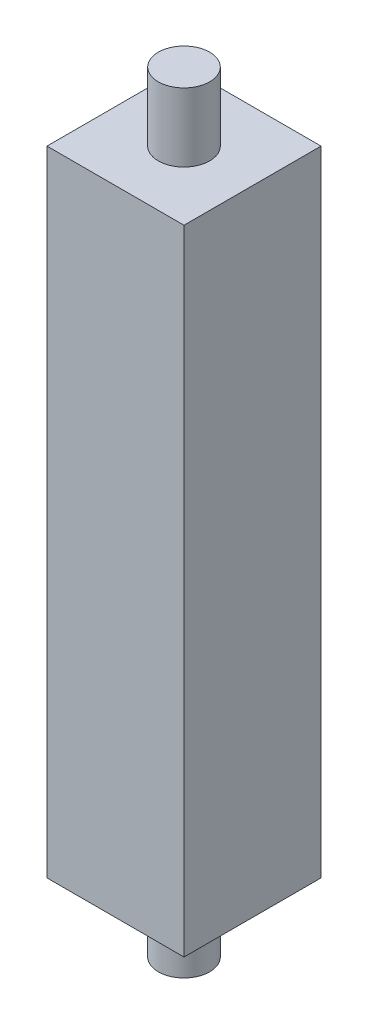
ISO-10303-21;
HEADER;
FILE_DESCRIPTION(('STEP AP214'),'2;1');
FILE_NAME('part.step','',(''),(''),'','','');
FILE_SCHEMA(('AUTOMOTIVE_DESIGN { 1 0 10303 214 1 1 1 1 }'));
ENDSEC;
DATA;
#1=APPLICATION_CONTEXT('core data for automotive mechanical design processes');
#2=APPLICATION_PROTOCOL_DEFINITION('international standard','automotive_design',2000,#1);
#3=PRODUCT_CONTEXT('',#1,'mechanical');
#4=PRODUCT('Part','Part','',(#3));
#5=PRODUCT_RELATED_PRODUCT_CATEGORY('part','',(#4));
#6=PRODUCT_DEFINITION_FORMATION('','',#4);
#7=PRODUCT_DEFINITION_CONTEXT('part definition',#1,'design');
#8=PRODUCT_DEFINITION('design','',#6,#7);
#9=PRODUCT_DEFINITION_SHAPE('','',#8);
#10=(LENGTH_UNIT() NAMED_UNIT(*) SI_UNIT(.MILLI.,.METRE.));
#11=(NAMED_UNIT(*) PLANE_ANGLE_UNIT() SI_UNIT($,.RADIAN.));
#12=(NAMED_UNIT(*) SI_UNIT($,.STERADIAN.) SOLID_ANGLE_UNIT());
#13=UNCERTAINTY_MEASURE_WITH_UNIT(LENGTH_MEASURE(1.E-05),#10,'distance_accuracy_value','');
#14=(GEOMETRIC_REPRESENTATION_CONTEXT(3) GLOBAL_UNCERTAINTY_ASSIGNED_CONTEXT((#13)) GLOBAL_UNIT_ASSIGNED_CONTEXT((#10,
#11,#12)) REPRESENTATION_CONTEXT('',''));
#15=CARTESIAN_POINT('',(0.,0.,0.));
#16=DIRECTION('',(0.,0.,1.));
#17=DIRECTION('',(1.,0.,0.));
#18=AXIS2_PLACEMENT_3D('',#15,#16,#17);
#19=CARTESIAN_POINT('',(20.,185.,-20.));
#20=DIRECTION('',(-1.,0.,0.));
#21=DIRECTION('',(0.,0.,1.));
#22=AXIS2_PLACEMENT_3D('',#19,#20,#21);
#23=PLANE('',#22);
#24=DIRECTION('',(0.,0.,-1.));
#25=VECTOR('',#24,1.);
#26=CARTESIAN_POINT('',(20.,0.,-20.));
#27=LINE('',#26,#25);
#28=CARTESIAN_POINT('',(20.,0.,20.));
#29=VERTEX_POINT('',#28);
#30=CARTESIAN_POINT('',(20.,0.,-20.));
#31=VERTEX_POINT('',#30);
#32=EDGE_CURVE('E112',#29,#31,#27,.T.);
#33=ORIENTED_EDGE('',*,*,#32,.T.);
#34=DIRECTION('',(0.,-1.,0.));
#35=VECTOR('',#34,1.);
#36=CARTESIAN_POINT('',(20.,185.,-20.));
#37=LINE('',#36,#35);
#38=CARTESIAN_POINT('',(20.,185.,-20.));
#39=VERTEX_POINT('',#38);
#40=EDGE_CURVE('E49',#39,#31,#37,.T.);
#41=ORIENTED_EDGE('',*,*,#40,.F.);
#42=DIRECTION('',(0.,0.,-1.));
#43=VECTOR('',#42,1.);
#44=CARTESIAN_POINT('',(20.,185.,-20.));
#45=LINE('',#44,#43);
#46=CARTESIAN_POINT('',(20.,185.,20.));
#47=VERTEX_POINT('',#46);
#48=EDGE_CURVE('E94',#47,#39,#45,.T.);
#49=ORIENTED_EDGE('',*,*,#48,.F.);
#50=DIRECTION('',(0.,-1.,0.));
#51=VECTOR('',#50,1.);
#52=CARTESIAN_POINT('',(20.,185.,20.));
#53=LINE('',#52,#51);
#54=EDGE_CURVE('E108',#47,#29,#53,.T.);
#55=ORIENTED_EDGE('',*,*,#54,.T.);
#56=EDGE_LOOP('',(#33,#41,#49,#55));
#57=FACE_BOUND('',#56,.T.);
#58=ADVANCED_FACE('F39',(#57),#23,.F.);
#59=CARTESIAN_POINT('',(-20.,185.,-20.));
#60=DIRECTION('',(0.,0.,1.));
#61=DIRECTION('',(1.,0.,0.));
#62=AXIS2_PLACEMENT_3D('',#59,#60,#61);
#63=PLANE('',#62);
#64=DIRECTION('',(-1.,0.,0.));
#65=VECTOR('',#64,1.);
#66=CARTESIAN_POINT('',(-20.,0.,-20.));
#67=LINE('',#66,#65);
#68=CARTESIAN_POINT('',(-20.,0.,-20.));
#69=VERTEX_POINT('',#68);
#70=EDGE_CURVE('E100',#31,#69,#67,.T.);
#71=ORIENTED_EDGE('',*,*,#70,.T.);
#72=DIRECTION('',(0.,-1.,0.));
#73=VECTOR('',#72,1.);
#74=CARTESIAN_POINT('',(-20.,185.,-20.));
#75=LINE('',#74,#73);
#76=CARTESIAN_POINT('',(-20.,185.,-20.));
#77=VERTEX_POINT('',#76);
#78=EDGE_CURVE('E98',#77,#69,#75,.T.);
#79=ORIENTED_EDGE('',*,*,#78,.F.);
#80=DIRECTION('',(-1.,0.,0.));
#81=VECTOR('',#80,1.);
#82=CARTESIAN_POINT('',(-20.,185.,-20.));
#83=LINE('',#82,#81);
#84=EDGE_CURVE('E89',#39,#77,#83,.T.);
#85=ORIENTED_EDGE('',*,*,#84,.F.);
#86=ORIENTED_EDGE('',*,*,#40,.T.);
#87=EDGE_LOOP('',(#71,#79,#85,#86));
#88=FACE_BOUND('',#87,.T.);
#89=ADVANCED_FACE('F99',(#88),#63,.F.);
#90=CARTESIAN_POINT('',(-20.,185.,-20.));
#91=DIRECTION('',(1.,0.,0.));
#92=DIRECTION('',(0.,0.,-1.));
#93=AXIS2_PLACEMENT_3D('',#90,#91,#92);
#94=PLANE('',#93);
#95=DIRECTION('',(0.,0.,1.));
#96=VECTOR('',#95,1.);
#97=CARTESIAN_POINT('',(-20.,0.,-20.));
#98=LINE('',#97,#96);
#99=CARTESIAN_POINT('',(-20.,0.,20.));
#100=VERTEX_POINT('',#99);
#101=EDGE_CURVE('E75',#69,#100,#98,.T.);
#102=ORIENTED_EDGE('',*,*,#101,.T.);
#103=DIRECTION('',(0.,-1.,0.));
#104=VECTOR('',#103,1.);
#105=CARTESIAN_POINT('',(-20.,185.,20.));
#106=LINE('',#105,#104);
#107=CARTESIAN_POINT('',(-20.,185.,20.));
#108=VERTEX_POINT('',#107);
#109=EDGE_CURVE('E102',#108,#100,#106,.T.);
#110=ORIENTED_EDGE('',*,*,#109,.F.);
#111=DIRECTION('',(0.,0.,1.));
#112=VECTOR('',#111,1.);
#113=CARTESIAN_POINT('',(-20.,185.,-20.));
#114=LINE('',#113,#112);
#115=EDGE_CURVE('E92',#77,#108,#114,.T.);
#116=ORIENTED_EDGE('',*,*,#115,.F.);
#117=ORIENTED_EDGE('',*,*,#78,.T.);
#118=EDGE_LOOP('',(#102,#110,#116,#117));
#119=FACE_BOUND('',#118,.T.);
#120=ADVANCED_FACE('F104',(#119),#94,.F.);
#121=CARTESIAN_POINT('',(-20.,185.,20.));
#122=DIRECTION('',(0.,0.,-1.));
#123=DIRECTION('',(-1.,0.,0.));
#124=AXIS2_PLACEMENT_3D('',#121,#122,#123);
#125=PLANE('',#124);
#126=DIRECTION('',(1.,0.,0.));
#127=VECTOR('',#126,1.);
#128=CARTESIAN_POINT('',(-20.,0.,20.));
#129=LINE('',#128,#127);
#130=EDGE_CURVE('E81',#100,#29,#129,.T.);
#131=ORIENTED_EDGE('',*,*,#130,.T.);
#132=ORIENTED_EDGE('',*,*,#54,.F.);
#133=DIRECTION('',(1.,0.,0.));
#134=VECTOR('',#133,1.);
#135=CARTESIAN_POINT('',(-20.,185.,20.));
#136=LINE('',#135,#134);
#137=EDGE_CURVE('E58',#108,#47,#136,.T.);
#138=ORIENTED_EDGE('',*,*,#137,.F.);
#139=ORIENTED_EDGE('',*,*,#109,.T.);
#140=EDGE_LOOP('',(#131,#132,#138,#139));
#141=FACE_BOUND('',#140,.T.);
#142=ADVANCED_FACE('F141',(#141),#125,.F.);
#143=CARTESIAN_POINT('',(0.,185.,0.));
#144=DIRECTION('',(0.,1.,0.));
#145=DIRECTION('',(0.,0.,1.));
#146=AXIS2_PLACEMENT_3D('',#143,#144,#145);
#147=PLANE('',#146);
#148=CARTESIAN_POINT('',(0.,185.,0.));
#149=DIRECTION('',(0.,1.,0.));
#150=DIRECTION('',(0.,0.,1.));
#151=AXIS2_PLACEMENT_3D('',#148,#149,#150);
#152=CIRCLE('',#151,7.5);
#153=CARTESIAN_POINT('',(0.,185.,7.5));
#154=VERTEX_POINT('',#153);
#155=EDGE_CURVE('E11',#154,#154,#152,.T.);
#156=ORIENTED_EDGE('',*,*,#155,.F.);
#157=EDGE_LOOP('',(#156));
#158=FACE_BOUND('',#157,.T.);
#159=ORIENTED_EDGE('',*,*,#48,.T.);
#160=ORIENTED_EDGE('',*,*,#84,.T.);
#161=ORIENTED_EDGE('',*,*,#115,.T.);
#162=ORIENTED_EDGE('',*,*,#137,.T.);
#163=EDGE_LOOP('',(#159,#160,#161,#162));
#164=FACE_BOUND('',#163,.T.);
#165=ADVANCED_FACE('F90',(#158,#164),#147,.T.);
#166=CARTESIAN_POINT('',(0.,0.,0.));
#167=DIRECTION('',(0.,1.,0.));
#168=DIRECTION('',(0.,0.,1.));
#169=AXIS2_PLACEMENT_3D('',#166,#167,#168);
#170=PLANE('',#169);
#171=CARTESIAN_POINT('',(0.,0.,0.));
#172=DIRECTION('',(0.,1.,0.));
#173=DIRECTION('',(0.,0.,1.));
#174=AXIS2_PLACEMENT_3D('',#171,#172,#173);
#175=CIRCLE('',#174,7.5);
#176=CARTESIAN_POINT('',(0.,0.,7.5));
#177=VERTEX_POINT('',#176);
#178=EDGE_CURVE('E42',#177,#177,#175,.T.);
#179=ORIENTED_EDGE('',*,*,#178,.T.);
#180=EDGE_LOOP('',(#179));
#181=FACE_BOUND('',#180,.T.);
#182=ORIENTED_EDGE('',*,*,#32,.F.);
#183=ORIENTED_EDGE('',*,*,#130,.F.);
#184=ORIENTED_EDGE('',*,*,#101,.F.);
#185=ORIENTED_EDGE('',*,*,#70,.F.);
#186=EDGE_LOOP('',(#182,#183,#184,#185));
#187=FACE_BOUND('',#186,.T.);
#188=ADVANCED_FACE('F129',(#181,#187),#170,.F.);
#189=CARTESIAN_POINT('',(0.,-20.,0.));
#190=DIRECTION('',(0.,1.,0.));
#191=DIRECTION('',(0.,0.,1.));
#192=AXIS2_PLACEMENT_3D('',#189,#190,#191);
#193=PLANE('',#192);
#194=CARTESIAN_POINT('',(0.,-20.,0.));
#195=DIRECTION('',(0.,1.,0.));
#196=DIRECTION('',(0.,0.,1.));
#197=AXIS2_PLACEMENT_3D('',#194,#195,#196);
#198=CIRCLE('',#197,7.5);
#199=CARTESIAN_POINT('',(0.,-20.,7.5));
#200=VERTEX_POINT('',#199);
#201=EDGE_CURVE('E210',#200,#200,#198,.T.);
#202=ORIENTED_EDGE('',*,*,#201,.F.);
#203=EDGE_LOOP('',(#202));
#204=FACE_BOUND('',#203,.T.);
#205=ADVANCED_FACE('F131',(#204),#193,.F.);
#206=CARTESIAN_POINT('',(0.,-20.,0.));
#207=DIRECTION('',(0.,1.,0.));
#208=DIRECTION('',(0.,0.,1.));
#209=AXIS2_PLACEMENT_3D('',#206,#207,#208);
#210=CYLINDRICAL_SURFACE('',#209,7.5);
#211=ORIENTED_EDGE('',*,*,#201,.T.);
#212=EDGE_LOOP('',(#211));
#213=FACE_BOUND('',#212,.T.);
#214=ORIENTED_EDGE('',*,*,#178,.F.);
#215=EDGE_LOOP('',(#214));
#216=FACE_BOUND('',#215,.T.);
#217=ADVANCED_FACE('F138',(#213,#216),#210,.T.);
#218=ORIENTED_EDGE('',*,*,#155,.T.);
#219=EDGE_LOOP('',(#218));
#220=FACE_BOUND('',#219,.T.);
#221=CARTESIAN_POINT('',(0.,205.,0.));
#222=DIRECTION('',(0.,1.,0.));
#223=DIRECTION('',(0.,0.,1.));
#224=AXIS2_PLACEMENT_3D('',#221,#222,#223);
#225=CIRCLE('',#224,7.5);
#226=CARTESIAN_POINT('',(0.,205.,7.5));
#227=VERTEX_POINT('',#226);
#228=EDGE_CURVE('E207',#227,#227,#225,.T.);
#229=ORIENTED_EDGE('',*,*,#228,.F.);
#230=EDGE_LOOP('',(#229));
#231=FACE_BOUND('',#230,.T.);
#232=ADVANCED_FACE('F182',(#220,#231),#210,.T.);
#233=CARTESIAN_POINT('',(0.,205.,0.));
#234=DIRECTION('',(0.,1.,0.));
#235=DIRECTION('',(0.,0.,1.));
#236=AXIS2_PLACEMENT_3D('',#233,#234,#235);
#237=PLANE('',#236);
#238=ORIENTED_EDGE('',*,*,#228,.T.);
#239=EDGE_LOOP('',(#238));
#240=FACE_BOUND('',#239,.T.);
#241=ADVANCED_FACE('F192',(#240),#237,.T.);
#242=CLOSED_SHELL('',(#58,#89,#120,#142,#165,#188,#205,#217,#232,#241));
#243=MANIFOLD_SOLID_BREP('B2',#242);
#244=ADVANCED_BREP_SHAPE_REPRESENTATION('',(#18,#243),#14);
#245=SHAPE_DEFINITION_REPRESENTATION(#9,#244);
ENDSEC;
END-ISO-10303-21;
